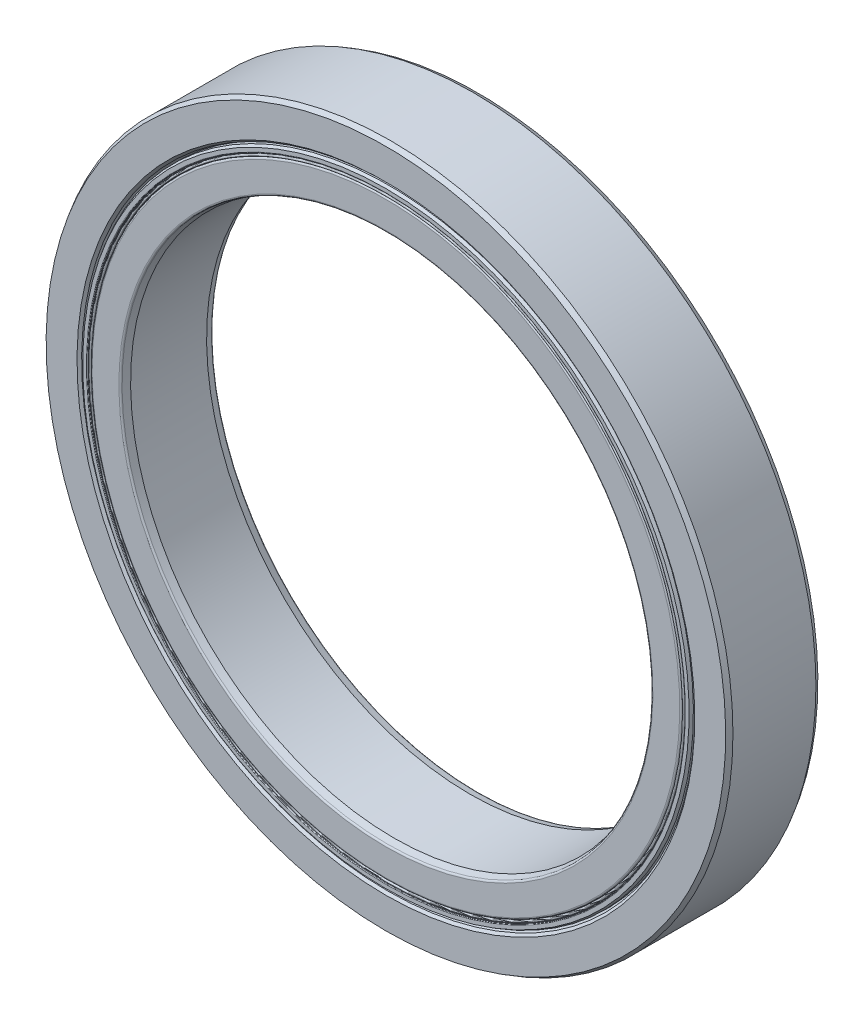
ISO-10303-21;
HEADER;
FILE_DESCRIPTION(('STEP AP214'),'2;1');
FILE_NAME('part.step','',(''),(''),'','','');
FILE_SCHEMA(('AUTOMOTIVE_DESIGN { 1 0 10303 214 1 1 1 1 }'));
ENDSEC;
DATA;
#1=APPLICATION_CONTEXT('core data for automotive mechanical design processes');
#2=APPLICATION_PROTOCOL_DEFINITION('international standard','automotive_design',2000,#1);
#3=PRODUCT_CONTEXT('',#1,'mechanical');
#4=PRODUCT('Part','Part','',(#3));
#5=PRODUCT_RELATED_PRODUCT_CATEGORY('part','',(#4));
#6=PRODUCT_DEFINITION_FORMATION('','',#4);
#7=PRODUCT_DEFINITION_CONTEXT('part definition',#1,'design');
#8=PRODUCT_DEFINITION('design','',#6,#7);
#9=PRODUCT_DEFINITION_SHAPE('','',#8);
#10=(LENGTH_UNIT() NAMED_UNIT(*) SI_UNIT(.MILLI.,.METRE.));
#11=(NAMED_UNIT(*) PLANE_ANGLE_UNIT() SI_UNIT($,.RADIAN.));
#12=(NAMED_UNIT(*) SI_UNIT($,.STERADIAN.) SOLID_ANGLE_UNIT());
#13=UNCERTAINTY_MEASURE_WITH_UNIT(LENGTH_MEASURE(1.E-05),#10,'distance_accuracy_value','');
#14=(GEOMETRIC_REPRESENTATION_CONTEXT(3) GLOBAL_UNCERTAINTY_ASSIGNED_CONTEXT((#13)) GLOBAL_UNIT_ASSIGNED_CONTEXT((#10,
#11,#12)) REPRESENTATION_CONTEXT('',''));
#15=CARTESIAN_POINT('',(0.,0.,0.));
#16=DIRECTION('',(0.,0.,1.));
#17=DIRECTION('',(1.,0.,0.));
#18=AXIS2_PLACEMENT_3D('',#15,#16,#17);
#19=CARTESIAN_POINT('',(0.,22.4533333333333,2.25));
#20=DIRECTION('',(0.,0.,1.));
#21=DIRECTION('',(0.,-1.,0.));
#22=AXIS2_PLACEMENT_3D('',#19,#20,#21);
#23=PLANE('',#22);
#24=CARTESIAN_POINT('',(0.,0.,2.25));
#25=DIRECTION('',(0.,0.,1.));
#26=DIRECTION('',(0.,-1.,0.));
#27=AXIS2_PLACEMENT_3D('',#24,#25,#26);
#28=CIRCLE('',#27,22.6933333333333);
#29=CARTESIAN_POINT('',(0.,-22.6933333333333,2.24999999999999));
#30=VERTEX_POINT('',#29);
#31=EDGE_CURVE('E11',#30,#30,#28,.T.);
#32=ORIENTED_EDGE('',*,*,#31,.F.);
#33=EDGE_LOOP('',(#32));
#34=FACE_BOUND('',#33,.T.);
#35=CARTESIAN_POINT('',(0.,0.,2.25));
#36=DIRECTION('',(0.,0.,1.));
#37=DIRECTION('',(0.,-1.,0.));
#38=AXIS2_PLACEMENT_3D('',#35,#36,#37);
#39=CIRCLE('',#38,22.4533333333333);
#40=CARTESIAN_POINT('',(0.,-22.4533333333333,2.24999999999999));
#41=VERTEX_POINT('',#40);
#42=EDGE_CURVE('E73',#41,#41,#39,.T.);
#43=ORIENTED_EDGE('',*,*,#42,.T.);
#44=EDGE_LOOP('',(#43));
#45=FACE_BOUND('',#44,.T.);
#46=ADVANCED_FACE('F48',(#34,#45),#23,.F.);
#47=CARTESIAN_POINT('',(0.,0.,3.5));
#48=DIRECTION('',(0.,0.,1.));
#49=DIRECTION('',(0.,-1.,0.));
#50=AXIS2_PLACEMENT_3D('',#47,#48,#49);
#51=CYLINDRICAL_SURFACE('',#50,22.6933333333333);
#52=CARTESIAN_POINT('',(0.,0.,3.33024931981155));
#53=DIRECTION('',(0.,0.,1.));
#54=DIRECTION('',(0.,-1.,0.));
#55=AXIS2_PLACEMENT_3D('',#52,#53,#54);
#56=CIRCLE('',#55,22.6933333333333);
#57=CARTESIAN_POINT('',(0.,-22.6933333333333,3.33024931981155));
#58=VERTEX_POINT('',#57);
#59=EDGE_CURVE('E54',#58,#58,#56,.T.);
#60=ORIENTED_EDGE('',*,*,#59,.F.);
#61=EDGE_LOOP('',(#60));
#62=FACE_BOUND('',#61,.T.);
#63=ORIENTED_EDGE('',*,*,#31,.T.);
#64=EDGE_LOOP('',(#63));
#65=FACE_BOUND('',#64,.T.);
#66=ADVANCED_FACE('F104',(#62,#65),#51,.T.);
#67=CARTESIAN_POINT('',(0.,0.,3.33024931981155));
#68=DIRECTION('',(0.,0.,-1.));
#69=DIRECTION('',(0.,1.,0.));
#70=AXIS2_PLACEMENT_3D('',#67,#68,#69);
#71=CONICAL_SURFACE('',#70,22.6933333333333,0.174532925199436);
#72=CARTESIAN_POINT('',(0.,0.,3.38933778499228));
#73=DIRECTION('',(0.,0.,1.));
#74=DIRECTION('',(0.,-1.,0.));
#75=AXIS2_PLACEMENT_3D('',#72,#73,#74);
#76=CIRCLE('',#75,22.6829144426733);
#77=CARTESIAN_POINT('',(0.,-22.6829144426733,3.38933778499228));
#78=VERTEX_POINT('',#77);
#79=EDGE_CURVE('E58',#78,#78,#76,.T.);
#80=ORIENTED_EDGE('',*,*,#79,.F.);
#81=EDGE_LOOP('',(#80));
#82=FACE_BOUND('',#81,.T.);
#83=ORIENTED_EDGE('',*,*,#59,.T.);
#84=EDGE_LOOP('',(#83));
#85=FACE_BOUND('',#84,.T.);
#86=ADVANCED_FACE('F99',(#82,#85),#71,.T.);
#87=CARTESIAN_POINT('',(0.,0.,3.38499999999999));
#88=DIRECTION('',(0.,0.,1.));
#89=DIRECTION('',(0.,-1.,0.));
#90=AXIS2_PLACEMENT_3D('',#87,#88,#89);
#91=TOROIDAL_SURFACE('',#90,22.6583136415091,0.0249803081758132);
#92=CARTESIAN_POINT('',(0.,0.,3.38499999999999));
#93=DIRECTION('',(0.,0.,1.));
#94=DIRECTION('',(0.,-1.,0.));
#95=AXIS2_PLACEMENT_3D('',#92,#93,#94);
#96=CIRCLE('',#95,22.6333333333333);
#97=CARTESIAN_POINT('',(0.,-22.6333333333333,3.38499999999999));
#98=VERTEX_POINT('',#97);
#99=EDGE_CURVE('E62',#98,#98,#96,.T.);
#100=ORIENTED_EDGE('',*,*,#99,.F.);
#101=EDGE_LOOP('',(#100));
#102=FACE_BOUND('',#101,.T.);
#103=ORIENTED_EDGE('',*,*,#79,.T.);
#104=EDGE_LOOP('',(#103));
#105=FACE_BOUND('',#104,.T.);
#106=ADVANCED_FACE('F93',(#102,#105),#91,.T.);
#107=CARTESIAN_POINT('',(0.,0.,3.5));
#108=DIRECTION('',(0.,0.,1.));
#109=DIRECTION('',(0.,-1.,0.));
#110=AXIS2_PLACEMENT_3D('',#107,#108,#109);
#111=CYLINDRICAL_SURFACE('',#110,22.6333333333333);
#112=CARTESIAN_POINT('',(0.,0.,3.40999999999999));
#113=DIRECTION('',(0.,0.,1.));
#114=DIRECTION('',(0.,-1.,0.));
#115=AXIS2_PLACEMENT_3D('',#112,#113,#114);
#116=CIRCLE('',#115,22.6333333333333);
#117=CARTESIAN_POINT('',(0.,-22.6333333333333,3.40999999999999));
#118=VERTEX_POINT('',#117);
#119=EDGE_CURVE('E67',#118,#118,#116,.T.);
#120=ORIENTED_EDGE('',*,*,#119,.F.);
#121=EDGE_LOOP('',(#120));
#122=FACE_BOUND('',#121,.T.);
#123=ORIENTED_EDGE('',*,*,#99,.T.);
#124=EDGE_LOOP('',(#123));
#125=FACE_BOUND('',#124,.T.);
#126=ADVANCED_FACE('F87',(#122,#125),#111,.T.);
#127=CARTESIAN_POINT('',(0.,0.,3.40999999999999));
#128=DIRECTION('',(0.,0.,1.));
#129=DIRECTION('',(0.,-1.,0.));
#130=AXIS2_PLACEMENT_3D('',#127,#128,#129);
#131=TOROIDAL_SURFACE('',#130,22.5433333333333,0.0899999999999998);
#132=CARTESIAN_POINT('',(0.,0.,3.40999999999999));
#133=DIRECTION('',(0.,0.,1.));
#134=DIRECTION('',(0.,-1.,0.));
#135=AXIS2_PLACEMENT_3D('',#132,#133,#134);
#136=CIRCLE('',#135,22.4533333333333);
#137=CARTESIAN_POINT('',(0.,-22.4533333333333,3.40999999999999));
#138=VERTEX_POINT('',#137);
#139=EDGE_CURVE('E70',#138,#138,#136,.T.);
#140=ORIENTED_EDGE('',*,*,#139,.F.);
#141=EDGE_LOOP('',(#140));
#142=FACE_BOUND('',#141,.T.);
#143=ORIENTED_EDGE('',*,*,#119,.T.);
#144=EDGE_LOOP('',(#143));
#145=FACE_BOUND('',#144,.T.);
#146=ADVANCED_FACE('F81',(#142,#145),#131,.T.);
#147=CARTESIAN_POINT('',(0.,0.,3.5));
#148=DIRECTION('',(0.,0.,1.));
#149=DIRECTION('',(0.,-1.,0.));
#150=AXIS2_PLACEMENT_3D('',#147,#148,#149);
#151=CYLINDRICAL_SURFACE('',#150,22.4533333333333);
#152=ORIENTED_EDGE('',*,*,#42,.F.);
#153=EDGE_LOOP('',(#152));
#154=FACE_BOUND('',#153,.T.);
#155=ORIENTED_EDGE('',*,*,#139,.T.);
#156=EDGE_LOOP('',(#155));
#157=FACE_BOUND('',#156,.T.);
#158=ADVANCED_FACE('F78',(#154,#157),#151,.F.);
#159=CLOSED_SHELL('',(#46,#66,#86,#106,#126,#146,#158));
#160=MANIFOLD_SOLID_BREP('B2',#159);
#161=CARTESIAN_POINT('',(0.,0.,-3.5));
#162=DIRECTION('',(0.,0.,1.));
#163=DIRECTION('',(0.,-1.,0.));
#164=AXIS2_PLACEMENT_3D('',#161,#162,#163);
#165=CONICAL_SURFACE('',#164,23.02,0.523598775598297);
#166=CARTESIAN_POINT('',(0.,0.,-3.29215390309174));
#167=DIRECTION('',(0.,0.,1.));
#168=DIRECTION('',(0.,-1.,0.));
#169=AXIS2_PLACEMENT_3D('',#166,#167,#168);
#170=CIRCLE('',#169,23.14);
#171=CARTESIAN_POINT('',(0.,-23.14,-3.29215390309174));
#172=VERTEX_POINT('',#171);
#173=EDGE_CURVE('E185',#172,#172,#170,.T.);
#174=ORIENTED_EDGE('',*,*,#173,.F.);
#175=EDGE_LOOP('',(#174));
#176=FACE_BOUND('',#175,.T.);
#177=CARTESIAN_POINT('',(0.,0.,-3.5));
#178=DIRECTION('',(0.,0.,1.));
#179=DIRECTION('',(0.,-1.,0.));
#180=AXIS2_PLACEMENT_3D('',#177,#178,#179);
#181=CIRCLE('',#180,23.02);
#182=CARTESIAN_POINT('',(0.,-23.02,-3.5));
#183=VERTEX_POINT('',#182);
#184=EDGE_CURVE('E47',#183,#183,#181,.T.);
#185=ORIENTED_EDGE('',*,*,#184,.T.);
#186=EDGE_LOOP('',(#185));
#187=FACE_BOUND('',#186,.T.);
#188=ADVANCED_FACE('F163',(#176,#187),#165,.T.);
#189=CARTESIAN_POINT('',(0.,23.02,-3.5));
#190=DIRECTION('',(0.,0.,1.));
#191=DIRECTION('',(0.,-1.,0.));
#192=AXIS2_PLACEMENT_3D('',#189,#190,#191);
#193=PLANE('',#192);
#194=ORIENTED_EDGE('',*,*,#184,.F.);
#195=EDGE_LOOP('',(#194));
#196=FACE_BOUND('',#195,.T.);
#197=CARTESIAN_POINT('',(0.,0.,-3.5));
#198=DIRECTION('',(0.,0.,1.));
#199=DIRECTION('',(0.,-1.,0.));
#200=AXIS2_PLACEMENT_3D('',#197,#198,#199);
#201=CIRCLE('',#200,22.7413333333333);
#202=CARTESIAN_POINT('',(0.,-22.7413333333333,-3.5));
#203=VERTEX_POINT('',#202);
#204=EDGE_CURVE('E169',#203,#203,#201,.T.);
#205=ORIENTED_EDGE('',*,*,#204,.T.);
#206=EDGE_LOOP('',(#205));
#207=FACE_BOUND('',#206,.T.);
#208=ADVANCED_FACE('F192',(#196,#207),#193,.F.);
#209=CARTESIAN_POINT('',(0.,0.,-3.452));
#210=DIRECTION('',(0.,0.,1.));
#211=DIRECTION('',(0.,-1.,0.));
#212=AXIS2_PLACEMENT_3D('',#209,#210,#211);
#213=TOROIDAL_SURFACE('',#212,22.7413333333333,0.0479999999999996);
#214=ORIENTED_EDGE('',*,*,#204,.F.);
#215=EDGE_LOOP('',(#214));
#216=FACE_BOUND('',#215,.T.);
#217=CARTESIAN_POINT('',(0.,0.,-3.452));
#218=DIRECTION('',(0.,0.,1.));
#219=DIRECTION('',(0.,-1.,0.));
#220=AXIS2_PLACEMENT_3D('',#217,#218,#219);
#221=CIRCLE('',#220,22.6933333333333);
#222=CARTESIAN_POINT('',(0.,-22.6933333333333,-3.452));
#223=VERTEX_POINT('',#222);
#224=EDGE_CURVE('E173',#223,#223,#221,.T.);
#225=ORIENTED_EDGE('',*,*,#224,.T.);
#226=EDGE_LOOP('',(#225));
#227=FACE_BOUND('',#226,.T.);
#228=ADVANCED_FACE('F196',(#216,#227),#213,.T.);
#229=CARTESIAN_POINT('',(0.,0.,3.5));
#230=DIRECTION('',(0.,0.,1.));
#231=DIRECTION('',(0.,-1.,0.));
#232=AXIS2_PLACEMENT_3D('',#229,#230,#231);
#233=CYLINDRICAL_SURFACE('',#232,22.6933333333333);
#234=ORIENTED_EDGE('',*,*,#224,.F.);
#235=EDGE_LOOP('',(#234));
#236=FACE_BOUND('',#235,.T.);
#237=CARTESIAN_POINT('',(0.,0.,-2.25));
#238=DIRECTION('',(0.,0.,1.));
#239=DIRECTION('',(0.,-1.,0.));
#240=AXIS2_PLACEMENT_3D('',#237,#238,#239);
#241=CIRCLE('',#240,22.6933333333333);
#242=CARTESIAN_POINT('',(0.,-22.6933333333333,-2.25000000000001));
#243=VERTEX_POINT('',#242);
#244=EDGE_CURVE('E177',#243,#243,#241,.T.);
#245=ORIENTED_EDGE('',*,*,#244,.T.);
#246=EDGE_LOOP('',(#245));
#247=FACE_BOUND('',#246,.T.);
#248=ADVANCED_FACE('F201',(#236,#247),#233,.F.);
#249=CARTESIAN_POINT('',(0.,23.14,-2.25));
#250=DIRECTION('',(0.,0.,-1.));
#251=DIRECTION('',(0.,1.,0.));
#252=AXIS2_PLACEMENT_3D('',#249,#250,#251);
#253=PLANE('',#252);
#254=ORIENTED_EDGE('',*,*,#244,.F.);
#255=EDGE_LOOP('',(#254));
#256=FACE_BOUND('',#255,.T.);
#257=CARTESIAN_POINT('',(0.,0.,-2.25));
#258=DIRECTION('',(0.,0.,1.));
#259=DIRECTION('',(0.,-1.,0.));
#260=AXIS2_PLACEMENT_3D('',#257,#258,#259);
#261=CIRCLE('',#260,23.14);
#262=CARTESIAN_POINT('',(0.,-23.14,-2.25000000000001));
#263=VERTEX_POINT('',#262);
#264=EDGE_CURVE('E182',#263,#263,#261,.T.);
#265=ORIENTED_EDGE('',*,*,#264,.T.);
#266=EDGE_LOOP('',(#265));
#267=FACE_BOUND('',#266,.T.);
#268=ADVANCED_FACE('F207',(#256,#267),#253,.F.);
#269=CARTESIAN_POINT('',(0.,0.,3.5));
#270=DIRECTION('',(0.,0.,1.));
#271=DIRECTION('',(0.,-1.,0.));
#272=AXIS2_PLACEMENT_3D('',#269,#270,#271);
#273=CYLINDRICAL_SURFACE('',#272,23.14);
#274=ORIENTED_EDGE('',*,*,#264,.F.);
#275=EDGE_LOOP('',(#274));
#276=FACE_BOUND('',#275,.T.);
#277=ORIENTED_EDGE('',*,*,#173,.T.);
#278=EDGE_LOOP('',(#277));
#279=FACE_BOUND('',#278,.T.);
#280=ADVANCED_FACE('F189',(#276,#279),#273,.T.);
#281=CLOSED_SHELL('',(#188,#208,#228,#248,#268,#280));
#282=MANIFOLD_SOLID_BREP('B6',#281);
#283=CARTESIAN_POINT('',(0.,23.14,2.25));
#284=DIRECTION('',(0.,0.,1.));
#285=DIRECTION('',(0.,-1.,0.));
#286=AXIS2_PLACEMENT_3D('',#283,#284,#285);
#287=PLANE('',#286);
#288=CARTESIAN_POINT('',(0.,0.,2.25));
#289=DIRECTION('',(0.,0.,1.));
#290=DIRECTION('',(0.,-1.,0.));
#291=AXIS2_PLACEMENT_3D('',#288,#289,#290);
#292=CIRCLE('',#291,23.14);
#293=CARTESIAN_POINT('',(0.,-23.14,2.24999999999999));
#294=VERTEX_POINT('',#293);
#295=EDGE_CURVE('E162',#294,#294,#292,.T.);
#296=ORIENTED_EDGE('',*,*,#295,.F.);
#297=EDGE_LOOP('',(#296));
#298=FACE_BOUND('',#297,.T.);
#299=CARTESIAN_POINT('',(0.,0.,2.25));
#300=DIRECTION('',(0.,0.,1.));
#301=DIRECTION('',(0.,-1.,0.));
#302=AXIS2_PLACEMENT_3D('',#299,#300,#301);
#303=CIRCLE('',#302,22.6933333333333);
#304=CARTESIAN_POINT('',(0.,-22.6933333333333,2.24999999999999));
#305=VERTEX_POINT('',#304);
#306=EDGE_CURVE('E283',#305,#305,#303,.T.);
#307=ORIENTED_EDGE('',*,*,#306,.T.);
#308=EDGE_LOOP('',(#307));
#309=FACE_BOUND('',#308,.T.);
#310=ADVANCED_FACE('F261',(#298,#309),#287,.F.);
#311=CARTESIAN_POINT('',(0.,0.,3.5));
#312=DIRECTION('',(0.,0.,1.));
#313=DIRECTION('',(0.,-1.,0.));
#314=AXIS2_PLACEMENT_3D('',#311,#312,#313);
#315=CYLINDRICAL_SURFACE('',#314,23.14);
#316=CARTESIAN_POINT('',(0.,0.,3.29215390309173));
#317=DIRECTION('',(0.,0.,1.));
#318=DIRECTION('',(0.,-1.,0.));
#319=AXIS2_PLACEMENT_3D('',#316,#317,#318);
#320=CIRCLE('',#319,23.14);
#321=CARTESIAN_POINT('',(0.,-23.14,3.29215390309173));
#322=VERTEX_POINT('',#321);
#323=EDGE_CURVE('E267',#322,#322,#320,.T.);
#324=ORIENTED_EDGE('',*,*,#323,.F.);
#325=EDGE_LOOP('',(#324));
#326=FACE_BOUND('',#325,.T.);
#327=ORIENTED_EDGE('',*,*,#295,.T.);
#328=EDGE_LOOP('',(#327));
#329=FACE_BOUND('',#328,.T.);
#330=ADVANCED_FACE('F308',(#326,#329),#315,.T.);
#331=CARTESIAN_POINT('',(0.,0.,3.29215390309173));
#332=DIRECTION('',(0.,0.,-1.));
#333=DIRECTION('',(0.,1.,0.));
#334=AXIS2_PLACEMENT_3D('',#331,#332,#333);
#335=CONICAL_SURFACE('',#334,23.14,0.523598775598299);
#336=CARTESIAN_POINT('',(0.,0.,3.49999999999999));
#337=DIRECTION('',(0.,0.,1.));
#338=DIRECTION('',(0.,-1.,0.));
#339=AXIS2_PLACEMENT_3D('',#336,#337,#338);
#340=CIRCLE('',#339,23.02);
#341=CARTESIAN_POINT('',(0.,-23.02,3.49999999999999));
#342=VERTEX_POINT('',#341);
#343=EDGE_CURVE('E271',#342,#342,#340,.T.);
#344=ORIENTED_EDGE('',*,*,#343,.F.);
#345=EDGE_LOOP('',(#344));
#346=FACE_BOUND('',#345,.T.);
#347=ORIENTED_EDGE('',*,*,#323,.T.);
#348=EDGE_LOOP('',(#347));
#349=FACE_BOUND('',#348,.T.);
#350=ADVANCED_FACE('F303',(#346,#349),#335,.T.);
#351=CARTESIAN_POINT('',(0.,23.02,3.5));
#352=DIRECTION('',(0.,0.,-1.));
#353=DIRECTION('',(0.,1.,0.));
#354=AXIS2_PLACEMENT_3D('',#351,#352,#353);
#355=PLANE('',#354);
#356=CARTESIAN_POINT('',(0.,0.,3.49999999999999));
#357=DIRECTION('',(0.,0.,1.));
#358=DIRECTION('',(0.,-1.,0.));
#359=AXIS2_PLACEMENT_3D('',#356,#357,#358);
#360=CIRCLE('',#359,22.7413333333333);
#361=CARTESIAN_POINT('',(0.,-22.7413333333333,3.49999999999999));
#362=VERTEX_POINT('',#361);
#363=EDGE_CURVE('E275',#362,#362,#360,.T.);
#364=ORIENTED_EDGE('',*,*,#363,.F.);
#365=EDGE_LOOP('',(#364));
#366=FACE_BOUND('',#365,.T.);
#367=ORIENTED_EDGE('',*,*,#343,.T.);
#368=EDGE_LOOP('',(#367));
#369=FACE_BOUND('',#368,.T.);
#370=ADVANCED_FACE('F297',(#366,#369),#355,.F.);
#371=CARTESIAN_POINT('',(0.,0.,3.45199999999999));
#372=DIRECTION('',(0.,0.,1.));
#373=DIRECTION('',(0.,-1.,0.));
#374=AXIS2_PLACEMENT_3D('',#371,#372,#373);
#375=TOROIDAL_SURFACE('',#374,22.7413333333333,0.0479999999999996);
#376=CARTESIAN_POINT('',(0.,0.,3.45199999999999));
#377=DIRECTION('',(0.,0.,1.));
#378=DIRECTION('',(0.,-1.,0.));
#379=AXIS2_PLACEMENT_3D('',#376,#377,#378);
#380=CIRCLE('',#379,22.6933333333333);
#381=CARTESIAN_POINT('',(0.,-22.6933333333333,3.45199999999999));
#382=VERTEX_POINT('',#381);
#383=EDGE_CURVE('E280',#382,#382,#380,.T.);
#384=ORIENTED_EDGE('',*,*,#383,.F.);
#385=EDGE_LOOP('',(#384));
#386=FACE_BOUND('',#385,.T.);
#387=ORIENTED_EDGE('',*,*,#363,.T.);
#388=EDGE_LOOP('',(#387));
#389=FACE_BOUND('',#388,.T.);
#390=ADVANCED_FACE('F291',(#386,#389),#375,.T.);
#391=CARTESIAN_POINT('',(0.,0.,3.5));
#392=DIRECTION('',(0.,0.,1.));
#393=DIRECTION('',(0.,-1.,0.));
#394=AXIS2_PLACEMENT_3D('',#391,#392,#393);
#395=CYLINDRICAL_SURFACE('',#394,22.6933333333333);
#396=ORIENTED_EDGE('',*,*,#306,.F.);
#397=EDGE_LOOP('',(#396));
#398=FACE_BOUND('',#397,.T.);
#399=ORIENTED_EDGE('',*,*,#383,.T.);
#400=EDGE_LOOP('',(#399));
#401=FACE_BOUND('',#400,.T.);
#402=ADVANCED_FACE('F288',(#398,#401),#395,.F.);
#403=CLOSED_SHELL('',(#310,#330,#350,#370,#390,#402));
#404=MANIFOLD_SOLID_BREP('B42',#403);
#405=CARTESIAN_POINT('',(-7.0445574151006,21.680918383142,0.));
#406=DIRECTION('',(0.,0.,1.));
#407=DIRECTION('',(-0.309016994374935,0.951056516295158,0.));
#408=AXIS2_PLACEMENT_3D('',#405,#406,#407);
#409=SPHERICAL_SURFACE('',#408,2.25);
#410=CARTESIAN_POINT('',(-7.0445574151006,21.680918383142,2.25));
#411=VERTEX_POINT('',#410);
#412=VERTEX_LOOP('',#411);
#413=FACE_BOUND('',#412,.T.);
#414=ADVANCED_FACE('F374',(#413),#409,.T.);
#415=CLOSED_SHELL('',(#414));
#416=MANIFOLD_SOLID_BREP('B157',#415);
#417=CARTESIAN_POINT('',(-13.3995444680938,18.4428907484344,0.));
#418=DIRECTION('',(0.,0.,1.));
#419=DIRECTION('',(-0.587785252292462,0.809016994374955,0.));
#420=AXIS2_PLACEMENT_3D('',#417,#418,#419);
#421=SPHERICAL_SURFACE('',#420,2.25);
#422=CARTESIAN_POINT('',(-13.3995444680938,18.4428907484344,2.25));
#423=VERTEX_POINT('',#422);
#424=VERTEX_LOOP('',#423);
#425=FACE_BOUND('',#424,.T.);
#426=ADVANCED_FACE('F393',(#425),#421,.T.);
#427=CLOSED_SHELL('',(#426));
#428=MANIFOLD_SOLID_BREP('B257',#427);
#429=CARTESIAN_POINT('',(-18.4428907484341,13.3995444680943,0.));
#430=DIRECTION('',(0.,0.,1.));
#431=DIRECTION('',(-0.80901699437494,0.587785252292483,0.));
#432=AXIS2_PLACEMENT_3D('',#429,#430,#431);
#433=SPHERICAL_SURFACE('',#432,2.25);
#434=CARTESIAN_POINT('',(-18.4428907484341,13.3995444680943,2.25));
#435=VERTEX_POINT('',#434);
#436=VERTEX_LOOP('',#435);
#437=FACE_BOUND('',#436,.T.);
#438=ADVANCED_FACE('F412',(#437),#433,.T.);
#439=CLOSED_SHELL('',(#438));
#440=MANIFOLD_SOLID_BREP('B370',#439);
#441=CARTESIAN_POINT('',(-21.6809183831418,7.04455741510113,0.));
#442=DIRECTION('',(0.,0.,1.));
#443=DIRECTION('',(-0.95105651629515,0.309016994374958,0.));
#444=AXIS2_PLACEMENT_3D('',#441,#442,#443);
#445=SPHERICAL_SURFACE('',#444,2.25);
#446=CARTESIAN_POINT('',(-21.6809183831418,7.04455741510113,2.25));
#447=VERTEX_POINT('',#446);
#448=VERTEX_LOOP('',#447);
#449=FACE_BOUND('',#448,.T.);
#450=ADVANCED_FACE('F431',(#449),#445,.T.);
#451=CLOSED_SHELL('',(#450));
#452=MANIFOLD_SOLID_BREP('B389',#451);
#453=CARTESIAN_POINT('',(-22.7966666666667,2.38782408763482E-13,0.));
#454=DIRECTION('',(0.,0.,1.));
#455=DIRECTION('',(-1.,0.,0.));
#456=AXIS2_PLACEMENT_3D('',#453,#454,#455);
#457=SPHERICAL_SURFACE('',#456,2.25);
#458=CARTESIAN_POINT('',(-22.7966666666667,2.3836909046877E-13,2.24999999999999));
#459=VERTEX_POINT('',#458);
#460=VERTEX_LOOP('',#459);
#461=FACE_BOUND('',#460,.T.);
#462=ADVANCED_FACE('F450',(#461),#457,.T.);
#463=CLOSED_SHELL('',(#462));
#464=MANIFOLD_SOLID_BREP('B408',#463);
#465=CARTESIAN_POINT('',(-21.6809183831419,-7.04455741510068,0.));
#466=DIRECTION('',(0.,0.,1.));
#467=DIRECTION('',(-0.951056516295157,-0.309016994374938,0.));
#468=AXIS2_PLACEMENT_3D('',#465,#466,#467);
#469=SPHERICAL_SURFACE('',#468,2.25);
#470=CARTESIAN_POINT('',(-21.6809183831419,-7.04455741510068,2.24999999999999));
#471=VERTEX_POINT('',#470);
#472=VERTEX_LOOP('',#471);
#473=FACE_BOUND('',#472,.T.);
#474=ADVANCED_FACE('F469',(#473),#469,.T.);
#475=CLOSED_SHELL('',(#474));
#476=MANIFOLD_SOLID_BREP('B427',#475);
#477=CARTESIAN_POINT('',(-18.4428907484344,-13.3995444680939,0.));
#478=DIRECTION('',(0.,0.,1.));
#479=DIRECTION('',(-0.809016994374953,-0.587785252292465,0.));
#480=AXIS2_PLACEMENT_3D('',#477,#478,#479);
#481=SPHERICAL_SURFACE('',#480,2.25);
#482=CARTESIAN_POINT('',(-18.4428907484344,-13.3995444680939,2.24999999999999));
#483=VERTEX_POINT('',#482);
#484=VERTEX_LOOP('',#483);
#485=FACE_BOUND('',#484,.T.);
#486=ADVANCED_FACE('F488',(#485),#481,.T.);
#487=CLOSED_SHELL('',(#486));
#488=MANIFOLD_SOLID_BREP('B446',#487);
#489=CARTESIAN_POINT('',(-13.3995444680942,-18.4428907484341,0.));
#490=DIRECTION('',(0.,0.,1.));
#491=DIRECTION('',(-0.58778525229248,-0.809016994374942,0.));
#492=AXIS2_PLACEMENT_3D('',#489,#490,#491);
#493=SPHERICAL_SURFACE('',#492,2.25);
#494=CARTESIAN_POINT('',(-13.3995444680942,-18.4428907484341,2.24999999999999));
#495=VERTEX_POINT('',#494);
#496=VERTEX_LOOP('',#495);
#497=FACE_BOUND('',#496,.T.);
#498=ADVANCED_FACE('F507',(#497),#493,.T.);
#499=CLOSED_SHELL('',(#498));
#500=MANIFOLD_SOLID_BREP('B465',#499);
#501=CARTESIAN_POINT('',(-7.04455741510106,-21.6809183831418,0.));
#502=DIRECTION('',(0.,0.,1.));
#503=DIRECTION('',(-0.309016994374955,-0.951056516295151,0.));
#504=AXIS2_PLACEMENT_3D('',#501,#502,#503);
#505=SPHERICAL_SURFACE('',#504,2.25);
#506=CARTESIAN_POINT('',(-7.04455741510106,-21.6809183831418,2.24999999999999));
#507=VERTEX_POINT('',#506);
#508=VERTEX_LOOP('',#507);
#509=FACE_BOUND('',#508,.T.);
#510=ADVANCED_FACE('F526',(#509),#505,.T.);
#511=CLOSED_SHELL('',(#510));
#512=MANIFOLD_SOLID_BREP('B484',#511);
#513=CARTESIAN_POINT('',(0.,-22.7966666666667,0.));
#514=DIRECTION('',(0.,0.,1.));
#515=DIRECTION('',(0.,-1.,0.));
#516=AXIS2_PLACEMENT_3D('',#513,#514,#515);
#517=SPHERICAL_SURFACE('',#516,2.25);
#518=CARTESIAN_POINT('',(0.,-22.7966666666667,2.24999999999999));
#519=VERTEX_POINT('',#518);
#520=VERTEX_LOOP('',#519);
#521=FACE_BOUND('',#520,.T.);
#522=ADVANCED_FACE('F545',(#521),#517,.T.);
#523=CLOSED_SHELL('',(#522));
#524=MANIFOLD_SOLID_BREP('B503',#523);
#525=CARTESIAN_POINT('',(7.04455741510074,-21.6809183831419,0.));
#526=DIRECTION('',(0.,0.,1.));
#527=DIRECTION('',(0.309016994374941,-0.951056516295156,0.));
#528=AXIS2_PLACEMENT_3D('',#525,#526,#527);
#529=SPHERICAL_SURFACE('',#528,2.25);
#530=CARTESIAN_POINT('',(7.04455741510074,-21.6809183831419,2.24999999999999));
#531=VERTEX_POINT('',#530);
#532=VERTEX_LOOP('',#531);
#533=FACE_BOUND('',#532,.T.);
#534=ADVANCED_FACE('F564',(#533),#529,.T.);
#535=CLOSED_SHELL('',(#534));
#536=MANIFOLD_SOLID_BREP('B522',#535);
#537=CARTESIAN_POINT('',(13.399544468094,-18.4428907484343,0.));
#538=DIRECTION('',(0.,0.,1.));
#539=DIRECTION('',(0.587785252292469,-0.809016994374951,0.));
#540=AXIS2_PLACEMENT_3D('',#537,#538,#539);
#541=SPHERICAL_SURFACE('',#540,2.25);
#542=CARTESIAN_POINT('',(13.399544468094,-18.4428907484343,2.24999999999999));
#543=VERTEX_POINT('',#542);
#544=VERTEX_LOOP('',#543);
#545=FACE_BOUND('',#544,.T.);
#546=ADVANCED_FACE('F583',(#545),#541,.T.);
#547=CLOSED_SHELL('',(#546));
#548=MANIFOLD_SOLID_BREP('B541',#547);
#549=CARTESIAN_POINT('',(18.4428907484342,-13.3995444680942,0.));
#550=DIRECTION('',(0.,0.,1.));
#551=DIRECTION('',(0.809016994374945,-0.587785252292477,0.));
#552=AXIS2_PLACEMENT_3D('',#549,#550,#551);
#553=SPHERICAL_SURFACE('',#552,2.25);
#554=CARTESIAN_POINT('',(18.4428907484342,-13.3995444680942,2.24999999999999));
#555=VERTEX_POINT('',#554);
#556=VERTEX_LOOP('',#555);
#557=FACE_BOUND('',#556,.T.);
#558=ADVANCED_FACE('F602',(#557),#553,.T.);
#559=CLOSED_SHELL('',(#558));
#560=MANIFOLD_SOLID_BREP('B560',#559);
#561=CARTESIAN_POINT('',(21.6809183831418,-7.04455741510098,0.));
#562=DIRECTION('',(0.,0.,1.));
#563=DIRECTION('',(0.951056516295152,-0.309016994374952,0.));
#564=AXIS2_PLACEMENT_3D('',#561,#562,#563);
#565=SPHERICAL_SURFACE('',#564,2.25);
#566=CARTESIAN_POINT('',(21.6809183831418,-7.04455741510098,2.24999999999999));
#567=VERTEX_POINT('',#566);
#568=VERTEX_LOOP('',#567);
#569=FACE_BOUND('',#568,.T.);
#570=ADVANCED_FACE('F621',(#569),#565,.T.);
#571=CLOSED_SHELL('',(#570));
#572=MANIFOLD_SOLID_BREP('B579',#571);
#573=CARTESIAN_POINT('',(22.7966666666667,0.,0.));
#574=DIRECTION('',(0.,0.,1.));
#575=DIRECTION('',(1.,0.,0.));
#576=AXIS2_PLACEMENT_3D('',#573,#574,#575);
#577=SPHERICAL_SURFACE('',#576,2.25);
#578=CARTESIAN_POINT('',(22.7966666666667,0.,2.24999999999999));
#579=VERTEX_POINT('',#578);
#580=VERTEX_LOOP('',#579);
#581=FACE_BOUND('',#580,.T.);
#582=ADVANCED_FACE('F640',(#581),#577,.T.);
#583=CLOSED_SHELL('',(#582));
#584=MANIFOLD_SOLID_BREP('B598',#583);
#585=CARTESIAN_POINT('',(21.6809183831419,7.04455741510083,0.));
#586=DIRECTION('',(0.,0.,1.));
#587=DIRECTION('',(0.951056516295155,0.309016994374945,0.));
#588=AXIS2_PLACEMENT_3D('',#585,#586,#587);
#589=SPHERICAL_SURFACE('',#588,2.25);
#590=CARTESIAN_POINT('',(21.6809183831419,7.04455741510083,2.25));
#591=VERTEX_POINT('',#590);
#592=VERTEX_LOOP('',#591);
#593=FACE_BOUND('',#592,.T.);
#594=ADVANCED_FACE('F659',(#593),#589,.T.);
#595=CLOSED_SHELL('',(#594));
#596=MANIFOLD_SOLID_BREP('B617',#595);
#597=CARTESIAN_POINT('',(18.4428907484343,13.399544468094,0.));
#598=DIRECTION('',(0.,0.,1.));
#599=DIRECTION('',(0.809016994374949,0.587785252292471,0.));
#600=AXIS2_PLACEMENT_3D('',#597,#598,#599);
#601=SPHERICAL_SURFACE('',#600,2.25);
#602=CARTESIAN_POINT('',(18.4428907484343,13.399544468094,2.25));
#603=VERTEX_POINT('',#602);
#604=VERTEX_LOOP('',#603);
#605=FACE_BOUND('',#604,.T.);
#606=ADVANCED_FACE('F678',(#605),#601,.T.);
#607=CLOSED_SHELL('',(#606));
#608=MANIFOLD_SOLID_BREP('B636',#607);
#609=CARTESIAN_POINT('',(13.3995444680941,18.4428907484342,0.));
#610=DIRECTION('',(0.,0.,1.));
#611=DIRECTION('',(0.587785252292474,0.809016994374947,0.));
#612=AXIS2_PLACEMENT_3D('',#609,#610,#611);
#613=SPHERICAL_SURFACE('',#612,2.25);
#614=CARTESIAN_POINT('',(13.3995444680941,18.4428907484342,2.25));
#615=VERTEX_POINT('',#614);
#616=VERTEX_LOOP('',#615);
#617=FACE_BOUND('',#616,.T.);
#618=ADVANCED_FACE('F697',(#617),#613,.T.);
#619=CLOSED_SHELL('',(#618));
#620=MANIFOLD_SOLID_BREP('B655',#619);
#621=CARTESIAN_POINT('',(7.0445574151009,21.6809183831419,0.));
#622=DIRECTION('',(0.,0.,1.));
#623=DIRECTION('',(0.309016994374948,0.951056516295154,0.));
#624=AXIS2_PLACEMENT_3D('',#621,#622,#623);
#625=SPHERICAL_SURFACE('',#624,2.25);
#626=CARTESIAN_POINT('',(7.0445574151009,21.6809183831419,2.25));
#627=VERTEX_POINT('',#626);
#628=VERTEX_LOOP('',#627);
#629=FACE_BOUND('',#628,.T.);
#630=ADVANCED_FACE('F716',(#629),#625,.T.);
#631=CLOSED_SHELL('',(#630));
#632=MANIFOLD_SOLID_BREP('B674',#631);
#633=CARTESIAN_POINT('',(0.,22.7966666666667,0.));
#634=DIRECTION('',(0.,0.,1.));
#635=DIRECTION('',(0.,1.,0.));
#636=AXIS2_PLACEMENT_3D('',#633,#634,#635);
#637=SPHERICAL_SURFACE('',#636,2.25);
#638=CARTESIAN_POINT('',(0.,22.7966666666667,2.25));
#639=VERTEX_POINT('',#638);
#640=VERTEX_LOOP('',#639);
#641=FACE_BOUND('',#640,.T.);
#642=ADVANCED_FACE('F737',(#641),#637,.T.);
#643=CLOSED_SHELL('',(#642));
#644=MANIFOLD_SOLID_BREP('B693',#643);
#645=CARTESIAN_POINT('',(0.,0.,-3.35851225534395));
#646=DIRECTION('',(0.,0.,1.));
#647=DIRECTION('',(0.,-1.,0.));
#648=AXIS2_PLACEMENT_3D('',#645,#646,#647);
#649=TOROIDAL_SURFACE('',#648,20.2733333333333,0.141487744656048);
#650=CARTESIAN_POINT('',(0.,0.,-3.5));
#651=DIRECTION('',(0.,0.,1.));
#652=DIRECTION('',(0.,-1.,0.));
#653=AXIS2_PLACEMENT_3D('',#650,#651,#652);
#654=CIRCLE('',#653,20.2733333333333);
#655=CARTESIAN_POINT('',(0.,-20.2733333333333,-3.5));
#656=VERTEX_POINT('',#655);
#657=EDGE_CURVE('E736',#656,#656,#654,.T.);
#658=ORIENTED_EDGE('',*,*,#657,.F.);
#659=EDGE_LOOP('',(#658));
#660=FACE_BOUND('',#659,.T.);
#661=CARTESIAN_POINT('',(0.,0.,-3.39513197830954));
#662=DIRECTION('',(0.,0.,1.));
#663=DIRECTION('',(0.,-1.,0.));
#664=AXIS2_PLACEMENT_3D('',#661,#662,#663);
#665=CIRCLE('',#664,20.1366666666667);
#666=CARTESIAN_POINT('',(0.,-20.1366666666667,-3.39513197830955));
#667=VERTEX_POINT('',#666);
#668=EDGE_CURVE('E797',#667,#667,#665,.T.);
#669=ORIENTED_EDGE('',*,*,#668,.T.);
#670=EDGE_LOOP('',(#669));
#671=FACE_BOUND('',#670,.T.);
#672=ADVANCED_FACE('F757',(#660,#671),#649,.T.);
#673=CARTESIAN_POINT('',(0.,20.2733333333333,-3.5));
#674=DIRECTION('',(0.,0.,1.));
#675=DIRECTION('',(0.,-1.,0.));
#676=AXIS2_PLACEMENT_3D('',#673,#674,#675);
#677=PLANE('',#676);
#678=CARTESIAN_POINT('',(0.,0.,-3.5));
#679=DIRECTION('',(0.,0.,1.));
#680=DIRECTION('',(0.,-1.,0.));
#681=AXIS2_PLACEMENT_3D('',#678,#679,#680);
#682=CIRCLE('',#681,22.3118455886773);
#683=CARTESIAN_POINT('',(0.,-22.3118455886773,-3.5));
#684=VERTEX_POINT('',#683);
#685=EDGE_CURVE('E763',#684,#684,#682,.T.);
#686=ORIENTED_EDGE('',*,*,#685,.F.);
#687=EDGE_LOOP('',(#686));
#688=FACE_BOUND('',#687,.T.);
#689=ORIENTED_EDGE('',*,*,#657,.T.);
#690=EDGE_LOOP('',(#689));
#691=FACE_BOUND('',#690,.T.);
#692=ADVANCED_FACE('F858',(#688,#691),#677,.F.);
#693=CARTESIAN_POINT('',(0.,0.,-3.35851225534396));
#694=DIRECTION('',(0.,0.,1.));
#695=DIRECTION('',(0.,-1.,0.));
#696=AXIS2_PLACEMENT_3D('',#693,#694,#695);
#697=TOROIDAL_SURFACE('',#696,22.3118455886773,0.141487744656044);
#698=CARTESIAN_POINT('',(0.,0.,-3.35851225534396));
#699=DIRECTION('',(0.,0.,1.));
#700=DIRECTION('',(0.,-1.,0.));
#701=AXIS2_PLACEMENT_3D('',#698,#699,#700);
#702=CIRCLE('',#701,22.4533333333333);
#703=CARTESIAN_POINT('',(0.,-22.4533333333333,-3.35851225534396));
#704=VERTEX_POINT('',#703);
#705=EDGE_CURVE('E767',#704,#704,#702,.T.);
#706=ORIENTED_EDGE('',*,*,#705,.F.);
#707=EDGE_LOOP('',(#706));
#708=FACE_BOUND('',#707,.T.);
#709=ORIENTED_EDGE('',*,*,#685,.T.);
#710=EDGE_LOOP('',(#709));
#711=FACE_BOUND('',#710,.T.);
#712=ADVANCED_FACE('F853',(#708,#711),#697,.T.);
#713=CARTESIAN_POINT('',(0.,0.,3.5));
#714=DIRECTION('',(0.,0.,1.));
#715=DIRECTION('',(0.,-1.,0.));
#716=AXIS2_PLACEMENT_3D('',#713,#714,#715);
#717=CYLINDRICAL_SURFACE('',#716,22.4533333333333);
#718=CARTESIAN_POINT('',(0.,0.,-2.22365065201848));
#719=DIRECTION('',(0.,0.,1.));
#720=DIRECTION('',(0.,-1.,0.));
#721=AXIS2_PLACEMENT_3D('',#718,#719,#720);
#722=CIRCLE('',#721,22.4533333333333);
#723=CARTESIAN_POINT('',(0.,-22.4533333333333,-2.22365065201849));
#724=VERTEX_POINT('',#723);
#725=EDGE_CURVE('E771',#724,#724,#722,.T.);
#726=ORIENTED_EDGE('',*,*,#725,.F.);
#727=EDGE_LOOP('',(#726));
#728=FACE_BOUND('',#727,.T.);
#729=ORIENTED_EDGE('',*,*,#705,.T.);
#730=EDGE_LOOP('',(#729));
#731=FACE_BOUND('',#730,.T.);
#732=ADVANCED_FACE('F847',(#728,#731),#717,.T.);
#733=CARTESIAN_POINT('',(0.,0.,0.));
#734=DIRECTION('',(0.,0.,1.));
#735=DIRECTION('',(0.,-1.,0.));
#736=AXIS2_PLACEMENT_3D('',#733,#734,#735);
#737=TOROIDAL_SURFACE('',#736,22.7966666666667,2.25);
#738=CARTESIAN_POINT('',(0.,0.,2.22365065201847));
#739=DIRECTION('',(0.,0.,1.));
#740=DIRECTION('',(0.,-1.,0.));
#741=AXIS2_PLACEMENT_3D('',#738,#739,#740);
#742=CIRCLE('',#741,22.4533333333333);
#743=CARTESIAN_POINT('',(0.,-22.4533333333333,2.22365065201847));
#744=VERTEX_POINT('',#743);
#745=EDGE_CURVE('E776',#744,#744,#742,.T.);
#746=ORIENTED_EDGE('',*,*,#745,.F.);
#747=EDGE_LOOP('',(#746));
#748=FACE_BOUND('',#747,.T.);
#749=ORIENTED_EDGE('',*,*,#725,.T.);
#750=EDGE_LOOP('',(#749));
#751=FACE_BOUND('',#750,.T.);
#752=ADVANCED_FACE('F841',(#748,#751),#737,.F.);
#753=CARTESIAN_POINT('',(0.,0.,3.5));
#754=DIRECTION('',(0.,0.,1.));
#755=DIRECTION('',(0.,-1.,0.));
#756=AXIS2_PLACEMENT_3D('',#753,#754,#755);
#757=CYLINDRICAL_SURFACE('',#756,22.4533333333333);
#758=CARTESIAN_POINT('',(0.,0.,3.35851225534395));
#759=DIRECTION('',(0.,0.,1.));
#760=DIRECTION('',(0.,-1.,0.));
#761=AXIS2_PLACEMENT_3D('',#758,#759,#760);
#762=CIRCLE('',#761,22.4533333333333);
#763=CARTESIAN_POINT('',(0.,-22.4533333333333,3.35851225534394));
#764=VERTEX_POINT('',#763);
#765=EDGE_CURVE('E779',#764,#764,#762,.T.);
#766=ORIENTED_EDGE('',*,*,#765,.F.);
#767=EDGE_LOOP('',(#766));
#768=FACE_BOUND('',#767,.T.);
#769=ORIENTED_EDGE('',*,*,#745,.T.);
#770=EDGE_LOOP('',(#769));
#771=FACE_BOUND('',#770,.T.);
#772=ADVANCED_FACE('F835',(#768,#771),#757,.T.);
#773=CARTESIAN_POINT('',(0.,0.,3.35851225534395));
#774=DIRECTION('',(0.,0.,1.));
#775=DIRECTION('',(0.,-1.,0.));
#776=AXIS2_PLACEMENT_3D('',#773,#774,#775);
#777=TOROIDAL_SURFACE('',#776,22.3118455886773,0.141487744656044);
#778=CARTESIAN_POINT('',(0.,0.,3.49999999999999));
#779=DIRECTION('',(0.,0.,1.));
#780=DIRECTION('',(0.,-1.,0.));
#781=AXIS2_PLACEMENT_3D('',#778,#779,#780);
#782=CIRCLE('',#781,22.3118455886773);
#783=CARTESIAN_POINT('',(0.,-22.3118455886773,3.49999999999999));
#784=VERTEX_POINT('',#783);
#785=EDGE_CURVE('E782',#784,#784,#782,.T.);
#786=ORIENTED_EDGE('',*,*,#785,.F.);
#787=EDGE_LOOP('',(#786));
#788=FACE_BOUND('',#787,.T.);
#789=ORIENTED_EDGE('',*,*,#765,.T.);
#790=EDGE_LOOP('',(#789));
#791=FACE_BOUND('',#790,.T.);
#792=ADVANCED_FACE('F829',(#788,#791),#777,.T.);
#793=CARTESIAN_POINT('',(0.,20.2733333333333,3.5));
#794=DIRECTION('',(0.,0.,-1.));
#795=DIRECTION('',(0.,1.,0.));
#796=AXIS2_PLACEMENT_3D('',#793,#794,#795);
#797=PLANE('',#796);
#798=CARTESIAN_POINT('',(0.,0.,3.49999999999999));
#799=DIRECTION('',(0.,0.,1.));
#800=DIRECTION('',(0.,-1.,0.));
#801=AXIS2_PLACEMENT_3D('',#798,#799,#800);
#802=CIRCLE('',#801,20.2733333333333);
#803=CARTESIAN_POINT('',(0.,-20.2733333333333,3.49999999999999));
#804=VERTEX_POINT('',#803);
#805=EDGE_CURVE('E785',#804,#804,#802,.T.);
#806=ORIENTED_EDGE('',*,*,#805,.F.);
#807=EDGE_LOOP('',(#806));
#808=FACE_BOUND('',#807,.T.);
#809=ORIENTED_EDGE('',*,*,#785,.T.);
#810=EDGE_LOOP('',(#809));
#811=FACE_BOUND('',#810,.T.);
#812=ADVANCED_FACE('F823',(#808,#811),#797,.F.);
#813=CARTESIAN_POINT('',(0.,0.,3.35851225534395));
#814=DIRECTION('',(0.,0.,1.));
#815=DIRECTION('',(0.,-1.,0.));
#816=AXIS2_PLACEMENT_3D('',#813,#814,#815);
#817=TOROIDAL_SURFACE('',#816,20.2733333333333,0.141487744656046);
#818=CARTESIAN_POINT('',(0.,0.,3.39513197830953));
#819=DIRECTION('',(0.,0.,1.));
#820=DIRECTION('',(0.,-1.,0.));
#821=AXIS2_PLACEMENT_3D('',#818,#819,#820);
#822=CIRCLE('',#821,20.1366666666667);
#823=CARTESIAN_POINT('',(0.,-20.1366666666667,3.39513197830953));
#824=VERTEX_POINT('',#823);
#825=EDGE_CURVE('E788',#824,#824,#822,.T.);
#826=ORIENTED_EDGE('',*,*,#825,.F.);
#827=EDGE_LOOP('',(#826));
#828=FACE_BOUND('',#827,.T.);
#829=ORIENTED_EDGE('',*,*,#805,.T.);
#830=EDGE_LOOP('',(#829));
#831=FACE_BOUND('',#830,.T.);
#832=ADVANCED_FACE('F817',(#828,#831),#817,.T.);
#833=CARTESIAN_POINT('',(0.,0.,3.39513197830953));
#834=DIRECTION('',(0.,0.,1.));
#835=DIRECTION('',(0.,-1.,0.));
#836=AXIS2_PLACEMENT_3D('',#833,#834,#835);
#837=CONICAL_SURFACE('',#836,20.1366666666667,0.26179938779915);
#838=CARTESIAN_POINT('',(0.,0.,2.88508503460844));
#839=DIRECTION('',(0.,0.,1.));
#840=DIRECTION('',(0.,-1.,0.));
#841=AXIS2_PLACEMENT_3D('',#838,#839,#840);
#842=CIRCLE('',#841,20.);
#843=CARTESIAN_POINT('',(0.,-20.,2.88508503460844));
#844=VERTEX_POINT('',#843);
#845=EDGE_CURVE('E791',#844,#844,#842,.T.);
#846=ORIENTED_EDGE('',*,*,#845,.F.);
#847=EDGE_LOOP('',(#846));
#848=FACE_BOUND('',#847,.T.);
#849=ORIENTED_EDGE('',*,*,#825,.T.);
#850=EDGE_LOOP('',(#849));
#851=FACE_BOUND('',#850,.T.);
#852=ADVANCED_FACE('F811',(#848,#851),#837,.F.);
#853=CARTESIAN_POINT('',(0.,0.,3.5));
#854=DIRECTION('',(0.,0.,1.));
#855=DIRECTION('',(0.,-1.,0.));
#856=AXIS2_PLACEMENT_3D('',#853,#854,#855);
#857=CYLINDRICAL_SURFACE('',#856,20.);
#858=CARTESIAN_POINT('',(0.,0.,-2.88508503460845));
#859=DIRECTION('',(0.,0.,1.));
#860=DIRECTION('',(0.,-1.,0.));
#861=AXIS2_PLACEMENT_3D('',#858,#859,#860);
#862=CIRCLE('',#861,20.);
#863=CARTESIAN_POINT('',(0.,-20.,-2.88508503460845));
#864=VERTEX_POINT('',#863);
#865=EDGE_CURVE('E794',#864,#864,#862,.T.);
#866=ORIENTED_EDGE('',*,*,#865,.F.);
#867=EDGE_LOOP('',(#866));
#868=FACE_BOUND('',#867,.T.);
#869=ORIENTED_EDGE('',*,*,#845,.T.);
#870=EDGE_LOOP('',(#869));
#871=FACE_BOUND('',#870,.T.);
#872=ADVANCED_FACE('F805',(#868,#871),#857,.F.);
#873=CARTESIAN_POINT('',(0.,0.,-2.88508503460845));
#874=DIRECTION('',(0.,0.,-1.));
#875=DIRECTION('',(0.,1.,0.));
#876=AXIS2_PLACEMENT_3D('',#873,#874,#875);
#877=CONICAL_SURFACE('',#876,20.,0.26179938779915);
#878=ORIENTED_EDGE('',*,*,#668,.F.);
#879=EDGE_LOOP('',(#878));
#880=FACE_BOUND('',#879,.T.);
#881=ORIENTED_EDGE('',*,*,#865,.T.);
#882=EDGE_LOOP('',(#881));
#883=FACE_BOUND('',#882,.T.);
#884=ADVANCED_FACE('F802',(#880,#883),#877,.F.);
#885=CLOSED_SHELL('',(#672,#692,#712,#732,#752,#772,#792,#812,#832,#852,#872,#884));
#886=MANIFOLD_SOLID_BREP('B712',#885);
#887=CARTESIAN_POINT('',(0.,0.,3.5));
#888=DIRECTION('',(0.,0.,1.));
#889=DIRECTION('',(0.,-1.,0.));
#890=AXIS2_PLACEMENT_3D('',#887,#888,#889);
#891=CYLINDRICAL_SURFACE('',#890,23.14);
#892=CARTESIAN_POINT('',(0.,0.,2.22365065201848));
#893=DIRECTION('',(0.,0.,1.));
#894=DIRECTION('',(0.,-1.,0.));
#895=AXIS2_PLACEMENT_3D('',#892,#893,#894);
#896=CIRCLE('',#895,23.14);
#897=CARTESIAN_POINT('',(0.,-23.14,2.22365065201847));
#898=VERTEX_POINT('',#897);
#899=EDGE_CURVE('E756',#898,#898,#896,.T.);
#900=ORIENTED_EDGE('',*,*,#899,.F.);
#901=EDGE_LOOP('',(#900));
#902=FACE_BOUND('',#901,.T.);
#903=CARTESIAN_POINT('',(0.,0.,2.94522774870362));
#904=DIRECTION('',(0.,0.,1.));
#905=DIRECTION('',(0.,-1.,0.));
#906=AXIS2_PLACEMENT_3D('',#903,#904,#905);
#907=CIRCLE('',#906,23.14);
#908=CARTESIAN_POINT('',(0.,-23.14,2.94522774870362));
#909=VERTEX_POINT('',#908);
#910=EDGE_CURVE('E990',#909,#909,#907,.T.);
#911=ORIENTED_EDGE('',*,*,#910,.T.);
#912=EDGE_LOOP('',(#911));
#913=FACE_BOUND('',#912,.T.);
#914=ADVANCED_FACE('F939',(#902,#913),#891,.F.);
#915=CARTESIAN_POINT('',(0.,0.,0.));
#916=DIRECTION('',(0.,0.,1.));
#917=DIRECTION('',(0.,-1.,0.));
#918=AXIS2_PLACEMENT_3D('',#915,#916,#917);
#919=TOROIDAL_SURFACE('',#918,22.7966666666667,2.25);
#920=CARTESIAN_POINT('',(0.,0.,-2.22365065201848));
#921=DIRECTION('',(0.,0.,1.));
#922=DIRECTION('',(0.,-1.,0.));
#923=AXIS2_PLACEMENT_3D('',#920,#921,#922);
#924=CIRCLE('',#923,23.14);
#925=CARTESIAN_POINT('',(0.,-23.14,-2.22365065201849));
#926=VERTEX_POINT('',#925);
#927=EDGE_CURVE('E946',#926,#926,#924,.T.);
#928=ORIENTED_EDGE('',*,*,#927,.F.);
#929=EDGE_LOOP('',(#928));
#930=FACE_BOUND('',#929,.T.);
#931=ORIENTED_EDGE('',*,*,#899,.T.);
#932=EDGE_LOOP('',(#931));
#933=FACE_BOUND('',#932,.T.);
#934=ADVANCED_FACE('F1052',(#930,#933),#919,.F.);
#935=CARTESIAN_POINT('',(0.,0.,3.5));
#936=DIRECTION('',(0.,0.,1.));
#937=DIRECTION('',(0.,-1.,0.));
#938=AXIS2_PLACEMENT_3D('',#935,#936,#937);
#939=CYLINDRICAL_SURFACE('',#938,23.14);
#940=CARTESIAN_POINT('',(0.,0.,-2.94522774870363));
#941=DIRECTION('',(0.,0.,1.));
#942=DIRECTION('',(0.,-1.,0.));
#943=AXIS2_PLACEMENT_3D('',#940,#941,#942);
#944=CIRCLE('',#943,23.14);
#945=CARTESIAN_POINT('',(0.,-23.14,-2.94522774870363));
#946=VERTEX_POINT('',#945);
#947=EDGE_CURVE('E951',#946,#946,#944,.T.);
#948=ORIENTED_EDGE('',*,*,#947,.F.);
#949=EDGE_LOOP('',(#948));
#950=FACE_BOUND('',#949,.T.);
#951=ORIENTED_EDGE('',*,*,#927,.T.);
#952=EDGE_LOOP('',(#951));
#953=FACE_BOUND('',#952,.T.);
#954=ADVANCED_FACE('F1047',(#950,#953),#939,.F.);
#955=CARTESIAN_POINT('',(0.,0.,-2.94522774870363));
#956=DIRECTION('',(0.,0.,-1.));
#957=DIRECTION('',(0.,1.,0.));
#958=AXIS2_PLACEMENT_3D('',#955,#956,#957);
#959=CONICAL_SURFACE('',#958,23.14,0.34906585039886);
#960=CARTESIAN_POINT('',(0.,0.,-3.325));
#961=DIRECTION('',(0.,0.,1.));
#962=DIRECTION('',(0.,-1.,0.));
#963=AXIS2_PLACEMENT_3D('',#960,#961,#962);
#964=CIRCLE('',#963,23.2782257952721);
#965=CARTESIAN_POINT('',(0.,-23.2782257952721,-3.32500000000001));
#966=VERTEX_POINT('',#965);
#967=EDGE_CURVE('E956',#966,#966,#964,.T.);
#968=ORIENTED_EDGE('',*,*,#967,.F.);
#969=EDGE_LOOP('',(#968));
#970=FACE_BOUND('',#969,.T.);
#971=ORIENTED_EDGE('',*,*,#947,.T.);
#972=EDGE_LOOP('',(#971));
#973=FACE_BOUND('',#972,.T.);
#974=ADVANCED_FACE('F1041',(#970,#973),#959,.F.);
#975=CARTESIAN_POINT('',(0.,0.,-3.325));
#976=DIRECTION('',(0.,0.,-1.));
#977=DIRECTION('',(0.,1.,0.));
#978=AXIS2_PLACEMENT_3D('',#975,#976,#977);
#979=CONICAL_SURFACE('',#978,23.2782257952721,0.785398163397441);
#980=CARTESIAN_POINT('',(0.,0.,-3.5));
#981=DIRECTION('',(0.,0.,1.));
#982=DIRECTION('',(0.,-1.,0.));
#983=AXIS2_PLACEMENT_3D('',#980,#981,#982);
#984=CIRCLE('',#983,23.4532257952721);
#985=CARTESIAN_POINT('',(0.,-23.4532257952721,-3.50000000000001));
#986=VERTEX_POINT('',#985);
#987=EDGE_CURVE('E962',#986,#986,#984,.T.);
#988=ORIENTED_EDGE('',*,*,#987,.F.);
#989=EDGE_LOOP('',(#988));
#990=FACE_BOUND('',#989,.T.);
#991=ORIENTED_EDGE('',*,*,#967,.T.);
#992=EDGE_LOOP('',(#991));
#993=FACE_BOUND('',#992,.T.);
#994=ADVANCED_FACE('F1035',(#990,#993),#979,.F.);
#995=CARTESIAN_POINT('',(0.,25.7979274057836,-3.5));
#996=DIRECTION('',(0.,0.,1.));
#997=DIRECTION('',(0.,-1.,0.));
#998=AXIS2_PLACEMENT_3D('',#995,#996,#997);
#999=PLANE('',#998);
#1000=CARTESIAN_POINT('',(0.,0.,-3.5));
#1001=DIRECTION('',(0.,0.,1.));
#1002=DIRECTION('',(0.,-1.,0.));
#1003=AXIS2_PLACEMENT_3D('',#1000,#1001,#1002);
#1004=CIRCLE('',#1003,25.7979274057836);
#1005=CARTESIAN_POINT('',(0.,-25.7979274057836,-3.50000000000001));
#1006=VERTEX_POINT('',#1005);
#1007=EDGE_CURVE('E966',#1006,#1006,#1004,.T.);
#1008=ORIENTED_EDGE('',*,*,#1007,.F.);
#1009=EDGE_LOOP('',(#1008));
#1010=FACE_BOUND('',#1009,.T.);
#1011=ORIENTED_EDGE('',*,*,#987,.T.);
#1012=EDGE_LOOP('',(#1011));
#1013=FACE_BOUND('',#1012,.T.);
#1014=ADVANCED_FACE('F1029',(#1010,#1013),#999,.F.);
#1015=CARTESIAN_POINT('',(0.,0.,-3.5));
#1016=DIRECTION('',(0.,0.,1.));
#1017=DIRECTION('',(0.,-1.,0.));
#1018=AXIS2_PLACEMENT_3D('',#1015,#1016,#1017);
#1019=CONICAL_SURFACE('',#1018,25.7979274057836,0.523598775598299);
#1020=CARTESIAN_POINT('',(0.,0.,-3.15));
#1021=DIRECTION('',(0.,0.,1.));
#1022=DIRECTION('',(0.,-1.,0.));
#1023=AXIS2_PLACEMENT_3D('',#1020,#1021,#1022);
#1024=CIRCLE('',#1023,26.);
#1025=CARTESIAN_POINT('',(0.,-26.,-3.15000000000001));
#1026=VERTEX_POINT('',#1025);
#1027=EDGE_CURVE('E970',#1026,#1026,#1024,.T.);
#1028=ORIENTED_EDGE('',*,*,#1027,.F.);
#1029=EDGE_LOOP('',(#1028));
#1030=FACE_BOUND('',#1029,.T.);
#1031=ORIENTED_EDGE('',*,*,#1007,.T.);
#1032=EDGE_LOOP('',(#1031));
#1033=FACE_BOUND('',#1032,.T.);
#1034=ADVANCED_FACE('F1023',(#1030,#1033),#1019,.T.);
#1035=CARTESIAN_POINT('',(0.,0.,3.5));
#1036=DIRECTION('',(0.,0.,1.));
#1037=DIRECTION('',(0.,-1.,0.));
#1038=AXIS2_PLACEMENT_3D('',#1035,#1036,#1037);
#1039=CYLINDRICAL_SURFACE('',#1038,26.);
#1040=CARTESIAN_POINT('',(0.,0.,3.15));
#1041=DIRECTION('',(0.,0.,1.));
#1042=DIRECTION('',(0.,-1.,0.));
#1043=AXIS2_PLACEMENT_3D('',#1040,#1041,#1042);
#1044=CIRCLE('',#1043,26.);
#1045=CARTESIAN_POINT('',(0.,-26.,3.14999999999999));
#1046=VERTEX_POINT('',#1045);
#1047=EDGE_CURVE('E974',#1046,#1046,#1044,.T.);
#1048=ORIENTED_EDGE('',*,*,#1047,.F.);
#1049=EDGE_LOOP('',(#1048));
#1050=FACE_BOUND('',#1049,.T.);
#1051=ORIENTED_EDGE('',*,*,#1027,.T.);
#1052=EDGE_LOOP('',(#1051));
#1053=FACE_BOUND('',#1052,.T.);
#1054=ADVANCED_FACE('F1017',(#1050,#1053),#1039,.T.);
#1055=CARTESIAN_POINT('',(0.,0.,3.15));
#1056=DIRECTION('',(0.,0.,-1.));
#1057=DIRECTION('',(0.,1.,0.));
#1058=AXIS2_PLACEMENT_3D('',#1055,#1056,#1057);
#1059=CONICAL_SURFACE('',#1058,26.,0.523598775598297);
#1060=CARTESIAN_POINT('',(0.,0.,3.5));
#1061=DIRECTION('',(0.,0.,1.));
#1062=DIRECTION('',(0.,-1.,0.));
#1063=AXIS2_PLACEMENT_3D('',#1060,#1061,#1062);
#1064=CIRCLE('',#1063,25.7979274057836);
#1065=CARTESIAN_POINT('',(0.,-25.7979274057836,3.49999999999999));
#1066=VERTEX_POINT('',#1065);
#1067=EDGE_CURVE('E978',#1066,#1066,#1064,.T.);
#1068=ORIENTED_EDGE('',*,*,#1067,.F.);
#1069=EDGE_LOOP('',(#1068));
#1070=FACE_BOUND('',#1069,.T.);
#1071=ORIENTED_EDGE('',*,*,#1047,.T.);
#1072=EDGE_LOOP('',(#1071));
#1073=FACE_BOUND('',#1072,.T.);
#1074=ADVANCED_FACE('F1011',(#1070,#1073),#1059,.T.);
#1075=CARTESIAN_POINT('',(0.,25.7979274057836,3.5));
#1076=DIRECTION('',(0.,0.,-1.));
#1077=DIRECTION('',(0.,1.,0.));
#1078=AXIS2_PLACEMENT_3D('',#1075,#1076,#1077);
#1079=PLANE('',#1078);
#1080=CARTESIAN_POINT('',(0.,0.,3.5));
#1081=DIRECTION('',(0.,0.,1.));
#1082=DIRECTION('',(0.,-1.,0.));
#1083=AXIS2_PLACEMENT_3D('',#1080,#1081,#1082);
#1084=CIRCLE('',#1083,23.4532257952721);
#1085=CARTESIAN_POINT('',(0.,-23.4532257952721,3.49999999999999));
#1086=VERTEX_POINT('',#1085);
#1087=EDGE_CURVE('E982',#1086,#1086,#1084,.T.);
#1088=ORIENTED_EDGE('',*,*,#1087,.F.);
#1089=EDGE_LOOP('',(#1088));
#1090=FACE_BOUND('',#1089,.T.);
#1091=ORIENTED_EDGE('',*,*,#1067,.T.);
#1092=EDGE_LOOP('',(#1091));
#1093=FACE_BOUND('',#1092,.T.);
#1094=ADVANCED_FACE('F1005',(#1090,#1093),#1079,.F.);
#1095=CARTESIAN_POINT('',(0.,0.,3.5));
#1096=DIRECTION('',(0.,0.,1.));
#1097=DIRECTION('',(0.,-1.,0.));
#1098=AXIS2_PLACEMENT_3D('',#1095,#1096,#1097);
#1099=CONICAL_SURFACE('',#1098,23.4532257952721,0.78539816339744);
#1100=CARTESIAN_POINT('',(0.,0.,3.325));
#1101=DIRECTION('',(0.,0.,1.));
#1102=DIRECTION('',(0.,-1.,0.));
#1103=AXIS2_PLACEMENT_3D('',#1100,#1101,#1102);
#1104=CIRCLE('',#1103,23.2782257952721);
#1105=CARTESIAN_POINT('',(0.,-23.2782257952721,3.32499999999999));
#1106=VERTEX_POINT('',#1105);
#1107=EDGE_CURVE('E986',#1106,#1106,#1104,.T.);
#1108=ORIENTED_EDGE('',*,*,#1107,.F.);
#1109=EDGE_LOOP('',(#1108));
#1110=FACE_BOUND('',#1109,.T.);
#1111=ORIENTED_EDGE('',*,*,#1087,.T.);
#1112=EDGE_LOOP('',(#1111));
#1113=FACE_BOUND('',#1112,.T.);
#1114=ADVANCED_FACE('F999',(#1110,#1113),#1099,.F.);
#1115=CARTESIAN_POINT('',(0.,0.,3.325));
#1116=DIRECTION('',(0.,0.,1.));
#1117=DIRECTION('',(0.,-1.,0.));
#1118=AXIS2_PLACEMENT_3D('',#1115,#1116,#1117);
#1119=CONICAL_SURFACE('',#1118,23.2782257952721,0.349065850398861);
#1120=ORIENTED_EDGE('',*,*,#910,.F.);
#1121=EDGE_LOOP('',(#1120));
#1122=FACE_BOUND('',#1121,.T.);
#1123=ORIENTED_EDGE('',*,*,#1107,.T.);
#1124=EDGE_LOOP('',(#1123));
#1125=FACE_BOUND('',#1124,.T.);
#1126=ADVANCED_FACE('F996',(#1122,#1125),#1119,.F.);
#1127=CLOSED_SHELL('',(#914,#934,#954,#974,#994,#1014,#1034,#1054,#1074,#1094,#1114,#1126));
#1128=MANIFOLD_SOLID_BREP('B731',#1127);
#1129=ADVANCED_BREP_SHAPE_REPRESENTATION('',(#18,#160,#282,#404,#416,#428,#440,#452,#464,#476,
#488,#500,#512,#524,#536,#548,#560,#572,#584,#596,#608,#620,#632,#644,#886,#1128),#14);
#1130=SHAPE_DEFINITION_REPRESENTATION(#9,#1129);
ENDSEC;
END-ISO-10303-21;
